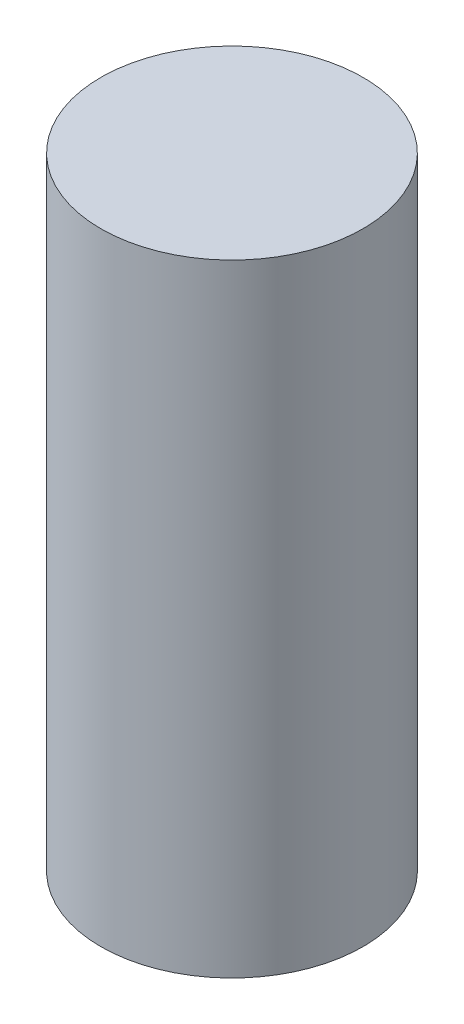
ISO-10303-21;
HEADER;
FILE_DESCRIPTION(('STEP AP214'),'2;1');
FILE_NAME('part.step','',(''),(''),'','','');
FILE_SCHEMA(('AUTOMOTIVE_DESIGN { 1 0 10303 214 1 1 1 1 }'));
ENDSEC;
DATA;
#1=APPLICATION_CONTEXT('core data for automotive mechanical design processes');
#2=APPLICATION_PROTOCOL_DEFINITION('international standard','automotive_design',2000,#1);
#3=PRODUCT_CONTEXT('',#1,'mechanical');
#4=PRODUCT('Part','Part','',(#3));
#5=PRODUCT_RELATED_PRODUCT_CATEGORY('part','',(#4));
#6=PRODUCT_DEFINITION_FORMATION('','',#4);
#7=PRODUCT_DEFINITION_CONTEXT('part definition',#1,'design');
#8=PRODUCT_DEFINITION('design','',#6,#7);
#9=PRODUCT_DEFINITION_SHAPE('','',#8);
#10=(LENGTH_UNIT() NAMED_UNIT(*) SI_UNIT(.MILLI.,.METRE.));
#11=(NAMED_UNIT(*) PLANE_ANGLE_UNIT() SI_UNIT($,.RADIAN.));
#12=(NAMED_UNIT(*) SI_UNIT($,.STERADIAN.) SOLID_ANGLE_UNIT());
#13=UNCERTAINTY_MEASURE_WITH_UNIT(LENGTH_MEASURE(1.E-05),#10,'distance_accuracy_value','');
#14=(GEOMETRIC_REPRESENTATION_CONTEXT(3) GLOBAL_UNCERTAINTY_ASSIGNED_CONTEXT((#13)) GLOBAL_UNIT_ASSIGNED_CONTEXT((#10,
#11,#12)) REPRESENTATION_CONTEXT('',''));
#15=CARTESIAN_POINT('',(0.,0.,0.));
#16=DIRECTION('',(0.,0.,1.));
#17=DIRECTION('',(1.,0.,0.));
#18=AXIS2_PLACEMENT_3D('',#15,#16,#17);
#19=CARTESIAN_POINT('',(0.,29.21,0.));
#20=DIRECTION('',(0.,-1.,0.));
#21=DIRECTION('',(0.,0.,-1.));
#22=AXIS2_PLACEMENT_3D('',#19,#20,#21);
#23=CYLINDRICAL_SURFACE('',#22,6.1595);
#24=CARTESIAN_POINT('',(0.,29.21,0.));
#25=DIRECTION('',(0.,1.,0.));
#26=DIRECTION('',(0.,0.,1.));
#27=AXIS2_PLACEMENT_3D('',#24,#25,#26);
#28=CIRCLE('',#27,6.1595);
#29=CARTESIAN_POINT('',(0.,29.21,6.1595));
#30=VERTEX_POINT('',#29);
#31=EDGE_CURVE('E10',#30,#30,#28,.T.);
#32=ORIENTED_EDGE('',*,*,#31,.F.);
#33=EDGE_LOOP('',(#32));
#34=FACE_BOUND('',#33,.T.);
#35=CARTESIAN_POINT('',(0.,0.,0.));
#36=DIRECTION('',(0.,1.,0.));
#37=DIRECTION('',(0.,0.,1.));
#38=AXIS2_PLACEMENT_3D('',#35,#36,#37);
#39=CIRCLE('',#38,6.1595);
#40=CARTESIAN_POINT('',(0.,0.,6.1595));
#41=VERTEX_POINT('',#40);
#42=EDGE_CURVE('E33',#41,#41,#39,.T.);
#43=ORIENTED_EDGE('',*,*,#42,.T.);
#44=EDGE_LOOP('',(#43));
#45=FACE_BOUND('',#44,.T.);
#46=ADVANCED_FACE('F30',(#34,#45),#23,.T.);
#47=CARTESIAN_POINT('',(0.,29.21,0.));
#48=DIRECTION('',(0.,1.,0.));
#49=DIRECTION('',(0.,0.,1.));
#50=AXIS2_PLACEMENT_3D('',#47,#48,#49);
#51=PLANE('',#50);
#52=ORIENTED_EDGE('',*,*,#31,.T.);
#53=EDGE_LOOP('',(#52));
#54=FACE_BOUND('',#53,.T.);
#55=ADVANCED_FACE('F45',(#54),#51,.T.);
#56=CARTESIAN_POINT('',(0.,0.,0.));
#57=DIRECTION('',(0.,1.,0.));
#58=DIRECTION('',(0.,0.,1.));
#59=AXIS2_PLACEMENT_3D('',#56,#57,#58);
#60=PLANE('',#59);
#61=ORIENTED_EDGE('',*,*,#42,.F.);
#62=EDGE_LOOP('',(#61));
#63=FACE_BOUND('',#62,.T.);
#64=ADVANCED_FACE('F43',(#63),#60,.F.);
#65=CLOSED_SHELL('',(#46,#55,#64));
#66=MANIFOLD_SOLID_BREP('B2',#65);
#67=ADVANCED_BREP_SHAPE_REPRESENTATION('',(#18,#66),#14);
#68=SHAPE_DEFINITION_REPRESENTATION(#9,#67);
ENDSEC;
END-ISO-10303-21;
